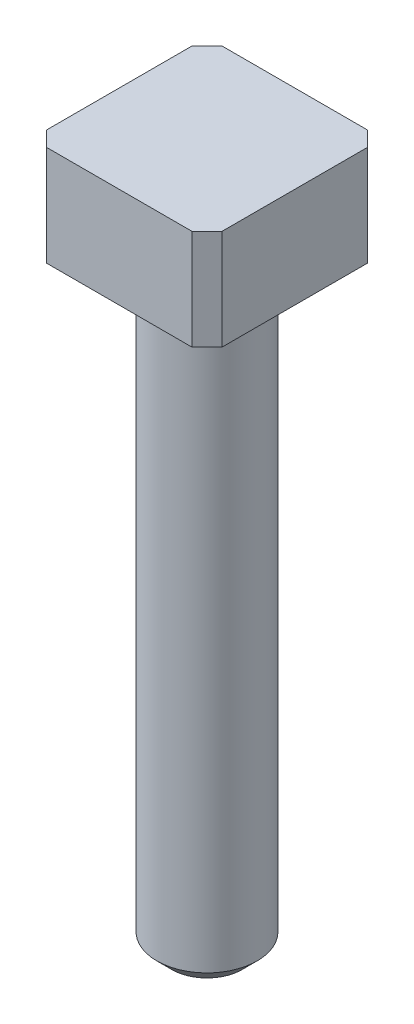
ISO-10303-21;
HEADER;
FILE_DESCRIPTION(('STEP AP214'),'2;1');
FILE_NAME('part.step','',(''),(''),'','','');
FILE_SCHEMA(('AUTOMOTIVE_DESIGN { 1 0 10303 214 1 1 1 1 }'));
ENDSEC;
DATA;
#1=APPLICATION_CONTEXT('core data for automotive mechanical design processes');
#2=APPLICATION_PROTOCOL_DEFINITION('international standard','automotive_design',2000,#1);
#3=PRODUCT_CONTEXT('',#1,'mechanical');
#4=PRODUCT('Part','Part','',(#3));
#5=PRODUCT_RELATED_PRODUCT_CATEGORY('part','',(#4));
#6=PRODUCT_DEFINITION_FORMATION('','',#4);
#7=PRODUCT_DEFINITION_CONTEXT('part definition',#1,'design');
#8=PRODUCT_DEFINITION('design','',#6,#7);
#9=PRODUCT_DEFINITION_SHAPE('','',#8);
#10=(LENGTH_UNIT() NAMED_UNIT(*) SI_UNIT(.MILLI.,.METRE.));
#11=(NAMED_UNIT(*) PLANE_ANGLE_UNIT() SI_UNIT($,.RADIAN.));
#12=(NAMED_UNIT(*) SI_UNIT($,.STERADIAN.) SOLID_ANGLE_UNIT());
#13=UNCERTAINTY_MEASURE_WITH_UNIT(LENGTH_MEASURE(1.E-05),#10,'distance_accuracy_value','');
#14=(GEOMETRIC_REPRESENTATION_CONTEXT(3) GLOBAL_UNCERTAINTY_ASSIGNED_CONTEXT((#13)) GLOBAL_UNIT_ASSIGNED_CONTEXT((#10,
#11,#12)) REPRESENTATION_CONTEXT('',''));
#15=CARTESIAN_POINT('',(0.,0.,0.));
#16=DIRECTION('',(0.,0.,1.));
#17=DIRECTION('',(1.,0.,0.));
#18=AXIS2_PLACEMENT_3D('',#15,#16,#17);
#19=CARTESIAN_POINT('',(-1.75,2.,1.75));
#20=DIRECTION('',(1.,0.,0.));
#21=DIRECTION('',(0.,0.,-1.));
#22=AXIS2_PLACEMENT_3D('',#19,#20,#21);
#23=PLANE('',#22);
#24=DIRECTION('',(0.,0.,1.));
#25=VECTOR('',#24,1.);
#26=CARTESIAN_POINT('',(-1.75,0.,1.75));
#27=LINE('',#26,#25);
#28=CARTESIAN_POINT('',(-1.75,0.,-1.45));
#29=VERTEX_POINT('',#28);
#30=CARTESIAN_POINT('',(-1.75,0.,1.45));
#31=VERTEX_POINT('',#30);
#32=EDGE_CURVE('E134',#29,#31,#27,.T.);
#33=ORIENTED_EDGE('',*,*,#32,.T.);
#34=DIRECTION('',(0.,1.,0.));
#35=VECTOR('',#34,1.);
#36=CARTESIAN_POINT('',(-1.75,2.,1.45));
#37=LINE('',#36,#35);
#38=CARTESIAN_POINT('',(-1.75,2.,1.45));
#39=VERTEX_POINT('',#38);
#40=EDGE_CURVE('E111',#31,#39,#37,.T.);
#41=ORIENTED_EDGE('',*,*,#40,.T.);
#42=DIRECTION('',(0.,0.,1.));
#43=VECTOR('',#42,1.);
#44=CARTESIAN_POINT('',(-1.75,2.,1.75));
#45=LINE('',#44,#43);
#46=CARTESIAN_POINT('',(-1.75,2.,-1.45));
#47=VERTEX_POINT('',#46);
#48=EDGE_CURVE('E144',#47,#39,#45,.T.);
#49=ORIENTED_EDGE('',*,*,#48,.F.);
#50=DIRECTION('',(0.,-1.,0.));
#51=VECTOR('',#50,1.);
#52=CARTESIAN_POINT('',(-1.75,2.,-1.45));
#53=LINE('',#52,#51);
#54=EDGE_CURVE('E116',#47,#29,#53,.T.);
#55=ORIENTED_EDGE('',*,*,#54,.T.);
#56=EDGE_LOOP('',(#33,#41,#49,#55));
#57=FACE_BOUND('',#56,.T.);
#58=ADVANCED_FACE('F38',(#57),#23,.F.);
#59=CARTESIAN_POINT('',(1.75,2.,1.75));
#60=DIRECTION('',(0.,0.,-1.));
#61=DIRECTION('',(-1.,0.,0.));
#62=AXIS2_PLACEMENT_3D('',#59,#60,#61);
#63=PLANE('',#62);
#64=DIRECTION('',(1.,0.,0.));
#65=VECTOR('',#64,1.);
#66=CARTESIAN_POINT('',(1.75,2.,1.75));
#67=LINE('',#66,#65);
#68=CARTESIAN_POINT('',(-1.45,2.,1.75));
#69=VERTEX_POINT('',#68);
#70=CARTESIAN_POINT('',(1.45,2.,1.75));
#71=VERTEX_POINT('',#70);
#72=EDGE_CURVE('E126',#69,#71,#67,.T.);
#73=ORIENTED_EDGE('',*,*,#72,.F.);
#74=DIRECTION('',(0.,-1.,0.));
#75=VECTOR('',#74,1.);
#76=CARTESIAN_POINT('',(-1.45,2.,1.75));
#77=LINE('',#76,#75);
#78=CARTESIAN_POINT('',(-1.45,0.,1.75));
#79=VERTEX_POINT('',#78);
#80=EDGE_CURVE('E110',#69,#79,#77,.T.);
#81=ORIENTED_EDGE('',*,*,#80,.T.);
#82=DIRECTION('',(1.,0.,0.));
#83=VECTOR('',#82,1.);
#84=CARTESIAN_POINT('',(1.75,0.,1.75));
#85=LINE('',#84,#83);
#86=CARTESIAN_POINT('',(1.45,0.,1.75));
#87=VERTEX_POINT('',#86);
#88=EDGE_CURVE('E123',#79,#87,#85,.T.);
#89=ORIENTED_EDGE('',*,*,#88,.T.);
#90=DIRECTION('',(0.,1.,0.));
#91=VECTOR('',#90,1.);
#92=CARTESIAN_POINT('',(1.45,2.,1.75));
#93=LINE('',#92,#91);
#94=EDGE_CURVE('E128',#87,#71,#93,.T.);
#95=ORIENTED_EDGE('',*,*,#94,.T.);
#96=EDGE_LOOP('',(#73,#81,#89,#95));
#97=FACE_BOUND('',#96,.T.);
#98=ADVANCED_FACE('F122',(#97),#63,.F.);
#99=CARTESIAN_POINT('',(1.75,2.,1.75));
#100=DIRECTION('',(-1.,0.,0.));
#101=DIRECTION('',(0.,0.,1.));
#102=AXIS2_PLACEMENT_3D('',#99,#100,#101);
#103=PLANE('',#102);
#104=DIRECTION('',(0.,0.,-1.));
#105=VECTOR('',#104,1.);
#106=CARTESIAN_POINT('',(1.75,2.,1.75));
#107=LINE('',#106,#105);
#108=CARTESIAN_POINT('',(1.75,2.,1.45));
#109=VERTEX_POINT('',#108);
#110=CARTESIAN_POINT('',(1.75,2.,-1.45));
#111=VERTEX_POINT('',#110);
#112=EDGE_CURVE('E223',#109,#111,#107,.T.);
#113=ORIENTED_EDGE('',*,*,#112,.F.);
#114=DIRECTION('',(0.,-1.,0.));
#115=VECTOR('',#114,1.);
#116=CARTESIAN_POINT('',(1.75,2.,1.45));
#117=LINE('',#116,#115);
#118=CARTESIAN_POINT('',(1.75,0.,1.45));
#119=VERTEX_POINT('',#118);
#120=EDGE_CURVE('E166',#109,#119,#117,.T.);
#121=ORIENTED_EDGE('',*,*,#120,.T.);
#122=DIRECTION('',(0.,0.,-1.));
#123=VECTOR('',#122,1.);
#124=CARTESIAN_POINT('',(1.75,0.,1.75));
#125=LINE('',#124,#123);
#126=CARTESIAN_POINT('',(1.75,0.,-1.45));
#127=VERTEX_POINT('',#126);
#128=EDGE_CURVE('E133',#119,#127,#125,.T.);
#129=ORIENTED_EDGE('',*,*,#128,.T.);
#130=DIRECTION('',(0.,1.,0.));
#131=VECTOR('',#130,1.);
#132=CARTESIAN_POINT('',(1.75,2.,-1.45));
#133=LINE('',#132,#131);
#134=EDGE_CURVE('E164',#127,#111,#133,.T.);
#135=ORIENTED_EDGE('',*,*,#134,.T.);
#136=EDGE_LOOP('',(#113,#121,#129,#135));
#137=FACE_BOUND('',#136,.T.);
#138=ADVANCED_FACE('F189',(#137),#103,.F.);
#139=CARTESIAN_POINT('',(1.75,2.,-1.75));
#140=DIRECTION('',(0.,0.,1.));
#141=DIRECTION('',(1.,0.,0.));
#142=AXIS2_PLACEMENT_3D('',#139,#140,#141);
#143=PLANE('',#142);
#144=DIRECTION('',(-1.,0.,0.));
#145=VECTOR('',#144,1.);
#146=CARTESIAN_POINT('',(1.75,0.,-1.75));
#147=LINE('',#146,#145);
#148=CARTESIAN_POINT('',(1.45,0.,-1.75));
#149=VERTEX_POINT('',#148);
#150=CARTESIAN_POINT('',(-1.45,0.,-1.75));
#151=VERTEX_POINT('',#150);
#152=EDGE_CURVE('E137',#149,#151,#147,.T.);
#153=ORIENTED_EDGE('',*,*,#152,.T.);
#154=DIRECTION('',(0.,1.,0.));
#155=VECTOR('',#154,1.);
#156=CARTESIAN_POINT('',(-1.45,2.,-1.75));
#157=LINE('',#156,#155);
#158=CARTESIAN_POINT('',(-1.45,2.,-1.75));
#159=VERTEX_POINT('',#158);
#160=EDGE_CURVE('E54',#151,#159,#157,.T.);
#161=ORIENTED_EDGE('',*,*,#160,.T.);
#162=DIRECTION('',(-1.,0.,0.));
#163=VECTOR('',#162,1.);
#164=CARTESIAN_POINT('',(1.75,2.,-1.75));
#165=LINE('',#164,#163);
#166=CARTESIAN_POINT('',(1.45,2.,-1.75));
#167=VERTEX_POINT('',#166);
#168=EDGE_CURVE('E145',#167,#159,#165,.T.);
#169=ORIENTED_EDGE('',*,*,#168,.F.);
#170=DIRECTION('',(0.,-1.,0.));
#171=VECTOR('',#170,1.);
#172=CARTESIAN_POINT('',(1.45,2.,-1.75));
#173=LINE('',#172,#171);
#174=EDGE_CURVE('E160',#167,#149,#173,.T.);
#175=ORIENTED_EDGE('',*,*,#174,.T.);
#176=EDGE_LOOP('',(#153,#161,#169,#175));
#177=FACE_BOUND('',#176,.T.);
#178=ADVANCED_FACE('F244',(#177),#143,.F.);
#179=CARTESIAN_POINT('',(0.,2.,0.));
#180=DIRECTION('',(0.,1.,0.));
#181=DIRECTION('',(0.,0.,1.));
#182=AXIS2_PLACEMENT_3D('',#179,#180,#181);
#183=PLANE('',#182);
#184=ORIENTED_EDGE('',*,*,#48,.T.);
#185=DIRECTION('',(-0.707106781186545,0.,-0.70710678118655));
#186=VECTOR('',#185,1.);
#187=CARTESIAN_POINT('',(-1.60000000000001,2.,1.6));
#188=LINE('',#187,#186);
#189=EDGE_CURVE('E158',#39,#69,#188,.F.);
#190=ORIENTED_EDGE('',*,*,#189,.T.);
#191=ORIENTED_EDGE('',*,*,#72,.T.);
#192=DIRECTION('',(-0.70710678118655,0.,0.707106781186546));
#193=VECTOR('',#192,1.);
#194=CARTESIAN_POINT('',(1.59999999999999,2.,1.6));
#195=LINE('',#194,#193);
#196=EDGE_CURVE('E154',#71,#109,#195,.F.);
#197=ORIENTED_EDGE('',*,*,#196,.T.);
#198=ORIENTED_EDGE('',*,*,#112,.T.);
#199=DIRECTION('',(0.707106781186546,0.,0.70710678118655));
#200=VECTOR('',#199,1.);
#201=CARTESIAN_POINT('',(1.6,2.,-1.59999999999999));
#202=LINE('',#201,#200);
#203=EDGE_CURVE('E61',#111,#167,#202,.F.);
#204=ORIENTED_EDGE('',*,*,#203,.T.);
#205=ORIENTED_EDGE('',*,*,#168,.T.);
#206=DIRECTION('',(0.70710678118655,0.,-0.707106781186546));
#207=VECTOR('',#206,1.);
#208=CARTESIAN_POINT('',(-1.59999999999999,2.,-1.6));
#209=LINE('',#208,#207);
#210=EDGE_CURVE('E156',#159,#47,#209,.F.);
#211=ORIENTED_EDGE('',*,*,#210,.T.);
#212=EDGE_LOOP('',(#184,#190,#191,#197,#198,#204,#205,#211));
#213=FACE_BOUND('',#212,.T.);
#214=ADVANCED_FACE('F222',(#213),#183,.T.);
#215=CARTESIAN_POINT('',(0.,0.,0.));
#216=DIRECTION('',(0.,1.,0.));
#217=DIRECTION('',(0.,0.,1.));
#218=AXIS2_PLACEMENT_3D('',#215,#216,#217);
#219=PLANE('',#218);
#220=CARTESIAN_POINT('',(0.,0.,0.));
#221=DIRECTION('',(0.,1.,0.));
#222=DIRECTION('',(0.,0.,1.));
#223=AXIS2_PLACEMENT_3D('',#220,#221,#222);
#224=CIRCLE('',#223,1.);
#225=CARTESIAN_POINT('',(0.,0.,1.));
#226=VERTEX_POINT('',#225);
#227=EDGE_CURVE('E139',#226,#226,#224,.T.);
#228=ORIENTED_EDGE('',*,*,#227,.T.);
#229=EDGE_LOOP('',(#228));
#230=FACE_BOUND('',#229,.T.);
#231=ORIENTED_EDGE('',*,*,#88,.F.);
#232=DIRECTION('',(0.707106781186545,0.,0.70710678118655));
#233=VECTOR('',#232,1.);
#234=CARTESIAN_POINT('',(-1.45,0.,1.75));
#235=LINE('',#234,#233);
#236=EDGE_CURVE('E106',#79,#31,#235,.F.);
#237=ORIENTED_EDGE('',*,*,#236,.T.);
#238=ORIENTED_EDGE('',*,*,#32,.F.);
#239=DIRECTION('',(-0.70710678118655,0.,0.707106781186546));
#240=VECTOR('',#239,1.);
#241=CARTESIAN_POINT('',(-1.75,0.,-1.45));
#242=LINE('',#241,#240);
#243=EDGE_CURVE('E117',#29,#151,#242,.F.);
#244=ORIENTED_EDGE('',*,*,#243,.T.);
#245=ORIENTED_EDGE('',*,*,#152,.F.);
#246=DIRECTION('',(-0.707106781186546,0.,-0.70710678118655));
#247=VECTOR('',#246,1.);
#248=CARTESIAN_POINT('',(1.45,0.,-1.75));
#249=LINE('',#248,#247);
#250=EDGE_CURVE('E127',#149,#127,#249,.F.);
#251=ORIENTED_EDGE('',*,*,#250,.T.);
#252=ORIENTED_EDGE('',*,*,#128,.F.);
#253=DIRECTION('',(0.70710678118655,0.,-0.707106781186546));
#254=VECTOR('',#253,1.);
#255=CARTESIAN_POINT('',(1.75,0.,1.45));
#256=LINE('',#255,#254);
#257=EDGE_CURVE('E132',#119,#87,#256,.F.);
#258=ORIENTED_EDGE('',*,*,#257,.T.);
#259=EDGE_LOOP('',(#231,#237,#238,#244,#245,#251,#252,#258));
#260=FACE_BOUND('',#259,.T.);
#261=ADVANCED_FACE('F130',(#230,#260),#219,.F.);
#262=CARTESIAN_POINT('',(0.,-12.,0.));
#263=DIRECTION('',(0.,1.,0.));
#264=DIRECTION('',(0.,0.,1.));
#265=AXIS2_PLACEMENT_3D('',#262,#263,#264);
#266=CYLINDRICAL_SURFACE('',#265,1.);
#267=CARTESIAN_POINT('',(0.,-11.7,0.));
#268=DIRECTION('',(0.,1.,0.));
#269=DIRECTION('',(0.,0.,1.));
#270=AXIS2_PLACEMENT_3D('',#267,#268,#269);
#271=CIRCLE('',#270,1.);
#272=CARTESIAN_POINT('',(0.,-11.7,1.));
#273=VERTEX_POINT('',#272);
#274=EDGE_CURVE('E47',#273,#273,#271,.T.);
#275=ORIENTED_EDGE('',*,*,#274,.T.);
#276=EDGE_LOOP('',(#275));
#277=FACE_BOUND('',#276,.T.);
#278=ORIENTED_EDGE('',*,*,#227,.F.);
#279=EDGE_LOOP('',(#278));
#280=FACE_BOUND('',#279,.T.);
#281=ADVANCED_FACE('F171',(#277,#280),#266,.T.);
#282=CARTESIAN_POINT('',(0.,-12.,0.));
#283=DIRECTION('',(0.,1.,0.));
#284=DIRECTION('',(0.,0.,1.));
#285=AXIS2_PLACEMENT_3D('',#282,#283,#284);
#286=PLANE('',#285);
#287=CARTESIAN_POINT('',(0.,-12.,0.));
#288=DIRECTION('',(0.,1.,0.));
#289=DIRECTION('',(0.,0.,1.));
#290=AXIS2_PLACEMENT_3D('',#287,#288,#289);
#291=CIRCLE('',#290,0.699999999999999);
#292=CARTESIAN_POINT('',(0.,-12.,0.699999999999999));
#293=VERTEX_POINT('',#292);
#294=EDGE_CURVE('E11',#293,#293,#291,.F.);
#295=ORIENTED_EDGE('',*,*,#294,.T.);
#296=EDGE_LOOP('',(#295));
#297=FACE_BOUND('',#296,.T.);
#298=ADVANCED_FACE('F200',(#297),#286,.F.);
#299=CARTESIAN_POINT('',(-1.45,2.,1.75));
#300=DIRECTION('',(0.70710678118655,0.,-0.707106781186545));
#301=DIRECTION('',(0.,-1.,0.));
#302=AXIS2_PLACEMENT_3D('',#299,#300,#301);
#303=PLANE('',#302);
#304=ORIENTED_EDGE('',*,*,#189,.F.);
#305=ORIENTED_EDGE('',*,*,#40,.F.);
#306=ORIENTED_EDGE('',*,*,#236,.F.);
#307=ORIENTED_EDGE('',*,*,#80,.F.);
#308=EDGE_LOOP('',(#304,#305,#306,#307));
#309=FACE_BOUND('',#308,.T.);
#310=ADVANCED_FACE('F109',(#309),#303,.F.);
#311=CARTESIAN_POINT('',(-1.75,2.,-1.45));
#312=DIRECTION('',(0.707106781186546,0.,0.70710678118655));
#313=DIRECTION('',(0.,-1.,0.));
#314=AXIS2_PLACEMENT_3D('',#311,#312,#313);
#315=PLANE('',#314);
#316=ORIENTED_EDGE('',*,*,#210,.F.);
#317=ORIENTED_EDGE('',*,*,#160,.F.);
#318=ORIENTED_EDGE('',*,*,#243,.F.);
#319=ORIENTED_EDGE('',*,*,#54,.F.);
#320=EDGE_LOOP('',(#316,#317,#318,#319));
#321=FACE_BOUND('',#320,.T.);
#322=ADVANCED_FACE('F199',(#321),#315,.F.);
#323=CARTESIAN_POINT('',(1.75,2.,1.45));
#324=DIRECTION('',(-0.707106781186546,0.,-0.70710678118655));
#325=DIRECTION('',(0.,-1.,0.));
#326=AXIS2_PLACEMENT_3D('',#323,#324,#325);
#327=PLANE('',#326);
#328=ORIENTED_EDGE('',*,*,#196,.F.);
#329=ORIENTED_EDGE('',*,*,#94,.F.);
#330=ORIENTED_EDGE('',*,*,#257,.F.);
#331=ORIENTED_EDGE('',*,*,#120,.F.);
#332=EDGE_LOOP('',(#328,#329,#330,#331));
#333=FACE_BOUND('',#332,.T.);
#334=ADVANCED_FACE('F180',(#333),#327,.F.);
#335=CARTESIAN_POINT('',(1.45,2.,-1.75));
#336=DIRECTION('',(-0.70710678118655,0.,0.707106781186546));
#337=DIRECTION('',(0.,-1.,0.));
#338=AXIS2_PLACEMENT_3D('',#335,#336,#337);
#339=PLANE('',#338);
#340=ORIENTED_EDGE('',*,*,#203,.F.);
#341=ORIENTED_EDGE('',*,*,#134,.F.);
#342=ORIENTED_EDGE('',*,*,#250,.F.);
#343=ORIENTED_EDGE('',*,*,#174,.F.);
#344=EDGE_LOOP('',(#340,#341,#342,#343));
#345=FACE_BOUND('',#344,.T.);
#346=ADVANCED_FACE('F175',(#345),#339,.F.);
#347=CARTESIAN_POINT('',(0.,-11.7,0.));
#348=DIRECTION('',(0.,1.,0.));
#349=DIRECTION('',(0.,0.,1.));
#350=AXIS2_PLACEMENT_3D('',#347,#348,#349);
#351=CONICAL_SURFACE('',#350,1.,0.78539816339745);
#352=ORIENTED_EDGE('',*,*,#294,.F.);
#353=EDGE_LOOP('',(#352));
#354=FACE_BOUND('',#353,.T.);
#355=ORIENTED_EDGE('',*,*,#274,.F.);
#356=EDGE_LOOP('',(#355));
#357=FACE_BOUND('',#356,.T.);
#358=ADVANCED_FACE('F41',(#354,#357),#351,.T.);
#359=CLOSED_SHELL('',(#58,#98,#138,#178,#214,#261,#281,#298,#310,#322,#334,#346,#358));
#360=MANIFOLD_SOLID_BREP('B2',#359);
#361=ADVANCED_BREP_SHAPE_REPRESENTATION('',(#18,#360),#14);
#362=SHAPE_DEFINITION_REPRESENTATION(#9,#361);
ENDSEC;
END-ISO-10303-21;
